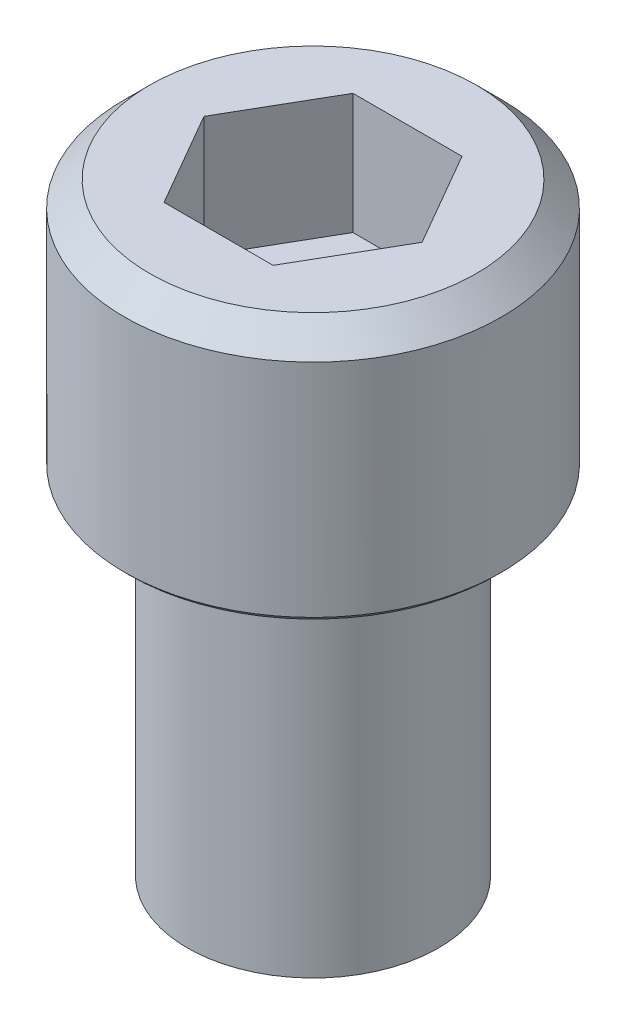
ISO-10303-21;
HEADER;
FILE_DESCRIPTION(('STEP AP214'),'2;1');
FILE_NAME('part.step','',(''),(''),'','','');
FILE_SCHEMA(('AUTOMOTIVE_DESIGN { 1 0 10303 214 1 1 1 1 }'));
ENDSEC;
DATA;
#1=APPLICATION_CONTEXT('core data for automotive mechanical design processes');
#2=APPLICATION_PROTOCOL_DEFINITION('international standard','automotive_design',2000,#1);
#3=PRODUCT_CONTEXT('',#1,'mechanical');
#4=PRODUCT('Part','Part','',(#3));
#5=PRODUCT_RELATED_PRODUCT_CATEGORY('part','',(#4));
#6=PRODUCT_DEFINITION_FORMATION('','',#4);
#7=PRODUCT_DEFINITION_CONTEXT('part definition',#1,'design');
#8=PRODUCT_DEFINITION('design','',#6,#7);
#9=PRODUCT_DEFINITION_SHAPE('','',#8);
#10=(LENGTH_UNIT() NAMED_UNIT(*) SI_UNIT(.MILLI.,.METRE.));
#11=(NAMED_UNIT(*) PLANE_ANGLE_UNIT() SI_UNIT($,.RADIAN.));
#12=(NAMED_UNIT(*) SI_UNIT($,.STERADIAN.) SOLID_ANGLE_UNIT());
#13=UNCERTAINTY_MEASURE_WITH_UNIT(LENGTH_MEASURE(1.E-05),#10,'distance_accuracy_value','');
#14=(GEOMETRIC_REPRESENTATION_CONTEXT(3) GLOBAL_UNCERTAINTY_ASSIGNED_CONTEXT((#13)) GLOBAL_UNIT_ASSIGNED_CONTEXT((#10,
#11,#12)) REPRESENTATION_CONTEXT('',''));
#15=CARTESIAN_POINT('',(0.,0.,0.));
#16=DIRECTION('',(0.,0.,1.));
#17=DIRECTION('',(1.,0.,0.));
#18=AXIS2_PLACEMENT_3D('',#15,#16,#17);
#19=CARTESIAN_POINT('',(0.,0.,0.));
#20=DIRECTION('',(0.,-1.,0.));
#21=DIRECTION('',(0.,0.,-1.));
#22=AXIS2_PLACEMENT_3D('',#19,#20,#21);
#23=CYLINDRICAL_SURFACE('',#22,3.175);
#24=CARTESIAN_POINT('',(0.,25.4,0.));
#25=DIRECTION('',(0.,-1.,0.));
#26=DIRECTION('',(0.,0.,-1.));
#27=AXIS2_PLACEMENT_3D('',#24,#25,#26);
#28=CIRCLE('',#27,3.175);
#29=CARTESIAN_POINT('',(0.,25.4,-3.175));
#30=VERTEX_POINT('',#29);
#31=EDGE_CURVE('E11',#30,#30,#28,.T.);
#32=ORIENTED_EDGE('',*,*,#31,.T.);
#33=EDGE_LOOP('',(#32));
#34=FACE_BOUND('',#33,.T.);
#35=CARTESIAN_POINT('',(0.,16.51,0.));
#36=DIRECTION('',(0.,-1.,0.));
#37=DIRECTION('',(0.,0.,-1.));
#38=AXIS2_PLACEMENT_3D('',#35,#36,#37);
#39=CIRCLE('',#38,3.175);
#40=CARTESIAN_POINT('',(0.,16.51,-3.175));
#41=VERTEX_POINT('',#40);
#42=EDGE_CURVE('E35',#41,#41,#39,.F.);
#43=ORIENTED_EDGE('',*,*,#42,.T.);
#44=EDGE_LOOP('',(#43));
#45=FACE_BOUND('',#44,.T.);
#46=ADVANCED_FACE('F32',(#34,#45),#23,.T.);
#47=CARTESIAN_POINT('',(-4.13544450815143,28.7020000000001,2.38760000000002));
#48=DIRECTION('',(0.,-1.,0.));
#49=DIRECTION('',(0.,0.,-1.));
#50=AXIS2_PLACEMENT_3D('',#47,#48,#49);
#51=PLANE('',#50);
#52=DIRECTION('',(0.5,0.,-0.866025403784439));
#53=VECTOR('',#52,1.);
#54=CARTESIAN_POINT('',(1.37848150271716,28.7020000000001,2.38760000000002));
#55=LINE('',#54,#53);
#56=CARTESIAN_POINT('',(1.37848150271716,28.7020000000001,2.38760000000002));
#57=VERTEX_POINT('',#56);
#58=CARTESIAN_POINT('',(2.75696300543431,28.7020000000001,0.));
#59=VERTEX_POINT('',#58);
#60=EDGE_CURVE('E77',#57,#59,#55,.T.);
#61=ORIENTED_EDGE('',*,*,#60,.T.);
#62=DIRECTION('',(-0.500000000000002,0.,-0.866025403784438));
#63=VECTOR('',#62,1.);
#64=CARTESIAN_POINT('',(2.75696300543431,28.7020000000001,0.));
#65=LINE('',#64,#63);
#66=CARTESIAN_POINT('',(1.37848150271715,28.7020000000001,-2.38759999999998));
#67=VERTEX_POINT('',#66);
#68=EDGE_CURVE('E116',#59,#67,#65,.T.);
#69=ORIENTED_EDGE('',*,*,#68,.T.);
#70=DIRECTION('',(-1.,0.,0.));
#71=VECTOR('',#70,1.);
#72=CARTESIAN_POINT('',(1.37848150271715,28.7020000000001,-2.38759999999998));
#73=LINE('',#72,#71);
#74=CARTESIAN_POINT('',(-1.37848150271715,28.7020000000001,-2.38759999999998));
#75=VERTEX_POINT('',#74);
#76=EDGE_CURVE('E112',#67,#75,#73,.T.);
#77=ORIENTED_EDGE('',*,*,#76,.T.);
#78=DIRECTION('',(-0.499999999999998,0.,0.86602540378444));
#79=VECTOR('',#78,1.);
#80=CARTESIAN_POINT('',(-1.37848150271715,28.7020000000001,-2.38759999999998));
#81=LINE('',#80,#79);
#82=CARTESIAN_POINT('',(-2.75696300543429,28.7020000000001,0.));
#83=VERTEX_POINT('',#82);
#84=EDGE_CURVE('E95',#75,#83,#81,.T.);
#85=ORIENTED_EDGE('',*,*,#84,.T.);
#86=DIRECTION('',(0.499999999999998,0.,0.86602540378444));
#87=VECTOR('',#86,1.);
#88=CARTESIAN_POINT('',(-2.75696300543429,28.7020000000001,0.));
#89=LINE('',#88,#87);
#90=CARTESIAN_POINT('',(-1.37848150271715,28.7020000000001,2.38760000000002));
#91=VERTEX_POINT('',#90);
#92=EDGE_CURVE('E90',#83,#91,#89,.T.);
#93=ORIENTED_EDGE('',*,*,#92,.T.);
#94=DIRECTION('',(1.,0.,0.));
#95=VECTOR('',#94,1.);
#96=CARTESIAN_POINT('',(-1.37848150271715,28.7020000000001,2.38760000000002));
#97=LINE('',#96,#95);
#98=EDGE_CURVE('E93',#91,#57,#97,.T.);
#99=ORIENTED_EDGE('',*,*,#98,.T.);
#100=EDGE_LOOP('',(#61,#69,#77,#85,#93,#99));
#101=FACE_BOUND('',#100,.T.);
#102=ADVANCED_FACE('F92',(#101),#51,.F.);
#103=CARTESIAN_POINT('',(-1.37848150271715,28.7020000000001,2.38760000000002));
#104=DIRECTION('',(0.,0.,1.));
#105=DIRECTION('',(1.,0.,0.));
#106=AXIS2_PLACEMENT_3D('',#103,#104,#105);
#107=PLANE('',#106);
#108=DIRECTION('',(0.,1.,0.));
#109=VECTOR('',#108,1.);
#110=CARTESIAN_POINT('',(1.37848150271716,28.7020000000001,2.38760000000002));
#111=LINE('',#110,#109);
#112=CARTESIAN_POINT('',(1.37848150271716,31.7500000000001,2.38760000000002));
#113=VERTEX_POINT('',#112);
#114=EDGE_CURVE('E103',#113,#57,#111,.F.);
#115=ORIENTED_EDGE('',*,*,#114,.T.);
#116=ORIENTED_EDGE('',*,*,#98,.F.);
#117=DIRECTION('',(0.,1.,0.));
#118=VECTOR('',#117,1.);
#119=CARTESIAN_POINT('',(-1.37848150271715,28.7020000000001,2.38760000000002));
#120=LINE('',#119,#118);
#121=CARTESIAN_POINT('',(-1.37848150271715,31.7500000000001,2.38760000000002));
#122=VERTEX_POINT('',#121);
#123=EDGE_CURVE('E99',#91,#122,#120,.T.);
#124=ORIENTED_EDGE('',*,*,#123,.T.);
#125=DIRECTION('',(1.,0.,0.));
#126=VECTOR('',#125,1.);
#127=CARTESIAN_POINT('',(4.7625,31.7500000000001,2.38760000000002));
#128=LINE('',#127,#126);
#129=EDGE_CURVE('E70',#113,#122,#128,.F.);
#130=ORIENTED_EDGE('',*,*,#129,.F.);
#131=EDGE_LOOP('',(#115,#116,#124,#130));
#132=FACE_BOUND('',#131,.T.);
#133=ADVANCED_FACE('F101',(#132),#107,.F.);
#134=CARTESIAN_POINT('',(-2.75696300543429,28.7020000000001,0.));
#135=DIRECTION('',(-0.86602540378444,0.,0.499999999999998));
#136=DIRECTION('',(0.499999999999998,0.,0.86602540378444));
#137=AXIS2_PLACEMENT_3D('',#134,#135,#136);
#138=PLANE('',#137);
#139=ORIENTED_EDGE('',*,*,#123,.F.);
#140=ORIENTED_EDGE('',*,*,#92,.F.);
#141=DIRECTION('',(0.,1.,0.));
#142=VECTOR('',#141,1.);
#143=CARTESIAN_POINT('',(-2.75696300543429,28.7020000000001,0.));
#144=LINE('',#143,#142);
#145=CARTESIAN_POINT('',(-2.75696300543429,31.7500000000001,0.));
#146=VERTEX_POINT('',#145);
#147=EDGE_CURVE('E109',#83,#146,#144,.T.);
#148=ORIENTED_EDGE('',*,*,#147,.T.);
#149=DIRECTION('',(-0.499999999999998,0.,-0.86602540378444));
#150=VECTOR('',#149,1.);
#151=CARTESIAN_POINT('',(-1.37848150271715,31.7500000000001,2.38760000000002));
#152=LINE('',#151,#150);
#153=EDGE_CURVE('E107',#122,#146,#152,.T.);
#154=ORIENTED_EDGE('',*,*,#153,.F.);
#155=EDGE_LOOP('',(#139,#140,#148,#154));
#156=FACE_BOUND('',#155,.T.);
#157=ADVANCED_FACE('F105',(#156),#138,.F.);
#158=CARTESIAN_POINT('',(-1.37848150271715,28.7020000000001,-2.38759999999998));
#159=DIRECTION('',(-0.86602540378444,0.,-0.499999999999998));
#160=DIRECTION('',(-0.499999999999998,0.,0.86602540378444));
#161=AXIS2_PLACEMENT_3D('',#158,#159,#160);
#162=PLANE('',#161);
#163=ORIENTED_EDGE('',*,*,#147,.F.);
#164=ORIENTED_EDGE('',*,*,#84,.F.);
#165=DIRECTION('',(0.,1.,0.));
#166=VECTOR('',#165,1.);
#167=CARTESIAN_POINT('',(-1.37848150271715,28.7020000000001,-2.38759999999998));
#168=LINE('',#167,#166);
#169=CARTESIAN_POINT('',(-1.37848150271715,31.7500000000001,-2.38759999999998));
#170=VERTEX_POINT('',#169);
#171=EDGE_CURVE('E114',#75,#170,#168,.T.);
#172=ORIENTED_EDGE('',*,*,#171,.T.);
#173=DIRECTION('',(0.499999999999998,0.,-0.86602540378444));
#174=VECTOR('',#173,1.);
#175=CARTESIAN_POINT('',(-2.75696300543429,31.7500000000001,0.));
#176=LINE('',#175,#174);
#177=EDGE_CURVE('E134',#146,#170,#176,.T.);
#178=ORIENTED_EDGE('',*,*,#177,.F.);
#179=EDGE_LOOP('',(#163,#164,#172,#178));
#180=FACE_BOUND('',#179,.T.);
#181=ADVANCED_FACE('F239',(#180),#162,.F.);
#182=CARTESIAN_POINT('',(1.37848150271715,28.7020000000001,-2.38759999999998));
#183=DIRECTION('',(0.,0.,-1.));
#184=DIRECTION('',(-1.,0.,0.));
#185=AXIS2_PLACEMENT_3D('',#182,#183,#184);
#186=PLANE('',#185);
#187=ORIENTED_EDGE('',*,*,#171,.F.);
#188=ORIENTED_EDGE('',*,*,#76,.F.);
#189=DIRECTION('',(0.,1.,0.));
#190=VECTOR('',#189,1.);
#191=CARTESIAN_POINT('',(1.37848150271715,28.7020000000001,-2.38759999999998));
#192=LINE('',#191,#190);
#193=CARTESIAN_POINT('',(1.37848150271715,31.7500000000001,-2.38759999999998));
#194=VERTEX_POINT('',#193);
#195=EDGE_CURVE('E118',#67,#194,#192,.T.);
#196=ORIENTED_EDGE('',*,*,#195,.T.);
#197=DIRECTION('',(1.,0.,0.));
#198=VECTOR('',#197,1.);
#199=CARTESIAN_POINT('',(4.7625,31.7500000000001,-2.38759999999998));
#200=LINE('',#199,#198);
#201=EDGE_CURVE('E131',#170,#194,#200,.T.);
#202=ORIENTED_EDGE('',*,*,#201,.F.);
#203=EDGE_LOOP('',(#187,#188,#196,#202));
#204=FACE_BOUND('',#203,.T.);
#205=ADVANCED_FACE('F231',(#204),#186,.F.);
#206=CARTESIAN_POINT('',(2.75696300543431,28.7020000000001,0.));
#207=DIRECTION('',(0.866025403784438,0.,-0.500000000000002));
#208=DIRECTION('',(-0.500000000000002,0.,-0.866025403784438));
#209=AXIS2_PLACEMENT_3D('',#206,#207,#208);
#210=PLANE('',#209);
#211=ORIENTED_EDGE('',*,*,#195,.F.);
#212=ORIENTED_EDGE('',*,*,#68,.F.);
#213=DIRECTION('',(0.,1.,0.));
#214=VECTOR('',#213,1.);
#215=CARTESIAN_POINT('',(2.75696300543431,28.7020000000001,0.));
#216=LINE('',#215,#214);
#217=CARTESIAN_POINT('',(2.75696300543431,31.7500000000001,0.));
#218=VERTEX_POINT('',#217);
#219=EDGE_CURVE('E50',#59,#218,#216,.T.);
#220=ORIENTED_EDGE('',*,*,#219,.T.);
#221=DIRECTION('',(0.500000000000002,0.,0.866025403784438));
#222=VECTOR('',#221,1.);
#223=CARTESIAN_POINT('',(1.37848150271715,31.7500000000001,-2.38759999999998));
#224=LINE('',#223,#222);
#225=EDGE_CURVE('E128',#194,#218,#224,.T.);
#226=ORIENTED_EDGE('',*,*,#225,.F.);
#227=EDGE_LOOP('',(#211,#212,#220,#226));
#228=FACE_BOUND('',#227,.T.);
#229=ADVANCED_FACE('F163',(#228),#210,.F.);
#230=CARTESIAN_POINT('',(1.37848150271716,28.7020000000001,2.38760000000002));
#231=DIRECTION('',(0.866025403784439,0.,0.5));
#232=DIRECTION('',(0.5,0.,-0.866025403784439));
#233=AXIS2_PLACEMENT_3D('',#230,#231,#232);
#234=PLANE('',#233);
#235=ORIENTED_EDGE('',*,*,#219,.F.);
#236=ORIENTED_EDGE('',*,*,#60,.F.);
#237=ORIENTED_EDGE('',*,*,#114,.F.);
#238=DIRECTION('',(-0.5,0.,0.866025403784439));
#239=VECTOR('',#238,1.);
#240=CARTESIAN_POINT('',(2.75696300543431,31.7500000000001,0.));
#241=LINE('',#240,#239);
#242=EDGE_CURVE('E124',#218,#113,#241,.T.);
#243=ORIENTED_EDGE('',*,*,#242,.F.);
#244=EDGE_LOOP('',(#235,#236,#237,#243));
#245=FACE_BOUND('',#244,.T.);
#246=ADVANCED_FACE('F154',(#245),#234,.F.);
#247=CARTESIAN_POINT('',(4.7625,31.7500000000001,0.));
#248=DIRECTION('',(0.,1.,0.));
#249=DIRECTION('',(0.,0.,1.));
#250=AXIS2_PLACEMENT_3D('',#247,#248,#249);
#251=PLANE('',#250);
#252=ORIENTED_EDGE('',*,*,#225,.T.);
#253=ORIENTED_EDGE('',*,*,#242,.T.);
#254=ORIENTED_EDGE('',*,*,#129,.T.);
#255=ORIENTED_EDGE('',*,*,#153,.T.);
#256=ORIENTED_EDGE('',*,*,#177,.T.);
#257=ORIENTED_EDGE('',*,*,#201,.T.);
#258=EDGE_LOOP('',(#252,#253,#254,#255,#256,#257));
#259=FACE_BOUND('',#258,.T.);
#260=CARTESIAN_POINT('',(0.,31.7499999999313,0.));
#261=DIRECTION('',(0.,-1.,0.));
#262=DIRECTION('',(0.,0.,-1.));
#263=AXIS2_PLACEMENT_3D('',#260,#261,#262);
#264=CIRCLE('',#263,4.12750000003825);
#265=CARTESIAN_POINT('',(0.,31.7499999999313,-4.12750000003825));
#266=VERTEX_POINT('',#265);
#267=EDGE_CURVE('E127',#266,#266,#264,.T.);
#268=ORIENTED_EDGE('',*,*,#267,.F.);
#269=EDGE_LOOP('',(#268));
#270=FACE_BOUND('',#269,.T.);
#271=ADVANCED_FACE('F152',(#259,#270),#251,.T.);
#272=CARTESIAN_POINT('',(0.,31.1150000000566,0.));
#273=DIRECTION('',(0.,-1.,0.));
#274=DIRECTION('',(0.,0.,-1.));
#275=AXIS2_PLACEMENT_3D('',#272,#273,#274);
#276=CONICAL_SURFACE('',#275,4.76249999985612,0.78539816335269);
#277=ORIENTED_EDGE('',*,*,#267,.T.);
#278=EDGE_LOOP('',(#277));
#279=FACE_BOUND('',#278,.T.);
#280=CARTESIAN_POINT('',(0.,31.1150000000001,0.));
#281=DIRECTION('',(0.,-1.,0.));
#282=DIRECTION('',(0.,0.,-1.));
#283=AXIS2_PLACEMENT_3D('',#280,#281,#282);
#284=CIRCLE('',#283,4.7625);
#285=CARTESIAN_POINT('',(0.,31.1150000000001,-4.7625));
#286=VERTEX_POINT('',#285);
#287=EDGE_CURVE('E142',#286,#286,#284,.T.);
#288=ORIENTED_EDGE('',*,*,#287,.F.);
#289=EDGE_LOOP('',(#288));
#290=FACE_BOUND('',#289,.T.);
#291=ADVANCED_FACE('F149',(#279,#290),#276,.T.);
#292=CARTESIAN_POINT('',(0.,0.,0.));
#293=DIRECTION('',(0.,-1.,0.));
#294=DIRECTION('',(0.,0.,-1.));
#295=AXIS2_PLACEMENT_3D('',#292,#293,#294);
#296=CYLINDRICAL_SURFACE('',#295,4.7625);
#297=ORIENTED_EDGE('',*,*,#287,.T.);
#298=EDGE_LOOP('',(#297));
#299=FACE_BOUND('',#298,.T.);
#300=CARTESIAN_POINT('',(0.,25.5270000000678,0.));
#301=DIRECTION('',(0.,1.,0.));
#302=DIRECTION('',(0.,0.,1.));
#303=AXIS2_PLACEMENT_3D('',#300,#301,#302);
#304=CIRCLE('',#303,4.76250000002665);
#305=CARTESIAN_POINT('',(0.,25.5270000000678,4.76250000002665));
#306=VERTEX_POINT('',#305);
#307=EDGE_CURVE('E139',#306,#306,#304,.F.);
#308=ORIENTED_EDGE('',*,*,#307,.F.);
#309=EDGE_LOOP('',(#308));
#310=FACE_BOUND('',#309,.T.);
#311=ADVANCED_FACE('F161',(#299,#310),#296,.T.);
#312=CARTESIAN_POINT('',(0.,25.5269999999541,0.));
#313=DIRECTION('',(0.,1.,0.));
#314=DIRECTION('',(0.,0.,1.));
#315=AXIS2_PLACEMENT_3D('',#312,#313,#314);
#316=CONICAL_SURFACE('',#315,4.7624999999698,0.785398163621241);
#317=CARTESIAN_POINT('',(0.,25.3999999999905,0.));
#318=DIRECTION('',(0.,1.,0.));
#319=DIRECTION('',(0.,0.,1.));
#320=AXIS2_PLACEMENT_3D('',#317,#318,#319);
#321=CIRCLE('',#320,4.63549999994939);
#322=CARTESIAN_POINT('',(0.,25.3999999999905,4.63549999994939));
#323=VERTEX_POINT('',#322);
#324=EDGE_CURVE('E41',#323,#323,#321,.F.);
#325=ORIENTED_EDGE('',*,*,#324,.F.);
#326=EDGE_LOOP('',(#325));
#327=FACE_BOUND('',#326,.T.);
#328=ORIENTED_EDGE('',*,*,#307,.T.);
#329=EDGE_LOOP('',(#328));
#330=FACE_BOUND('',#329,.T.);
#331=ADVANCED_FACE('F176',(#327,#330),#316,.T.);
#332=CARTESIAN_POINT('',(3.175,25.4,0.));
#333=DIRECTION('',(0.,-1.,0.));
#334=DIRECTION('',(0.,0.,-1.));
#335=AXIS2_PLACEMENT_3D('',#332,#333,#334);
#336=PLANE('',#335);
#337=ORIENTED_EDGE('',*,*,#31,.F.);
#338=EDGE_LOOP('',(#337));
#339=FACE_BOUND('',#338,.T.);
#340=ORIENTED_EDGE('',*,*,#324,.T.);
#341=EDGE_LOOP('',(#340));
#342=FACE_BOUND('',#341,.T.);
#343=ADVANCED_FACE('F168',(#339,#342),#336,.T.);
#344=CARTESIAN_POINT('',(0.,16.51,0.));
#345=DIRECTION('',(0.,-1.,0.));
#346=DIRECTION('',(0.,0.,-1.));
#347=AXIS2_PLACEMENT_3D('',#344,#345,#346);
#348=PLANE('',#347);
#349=ORIENTED_EDGE('',*,*,#42,.F.);
#350=EDGE_LOOP('',(#349));
#351=FACE_BOUND('',#350,.T.);
#352=ADVANCED_FACE('F173',(#351),#348,.T.);
#353=CLOSED_SHELL('',(#46,#102,#133,#157,#181,#205,#229,#246,#271,#291,#311,#331,#343,#352));
#354=MANIFOLD_SOLID_BREP('B2',#353);
#355=ADVANCED_BREP_SHAPE_REPRESENTATION('',(#18,#354),#14);
#356=SHAPE_DEFINITION_REPRESENTATION(#9,#355);
ENDSEC;
END-ISO-10303-21;
